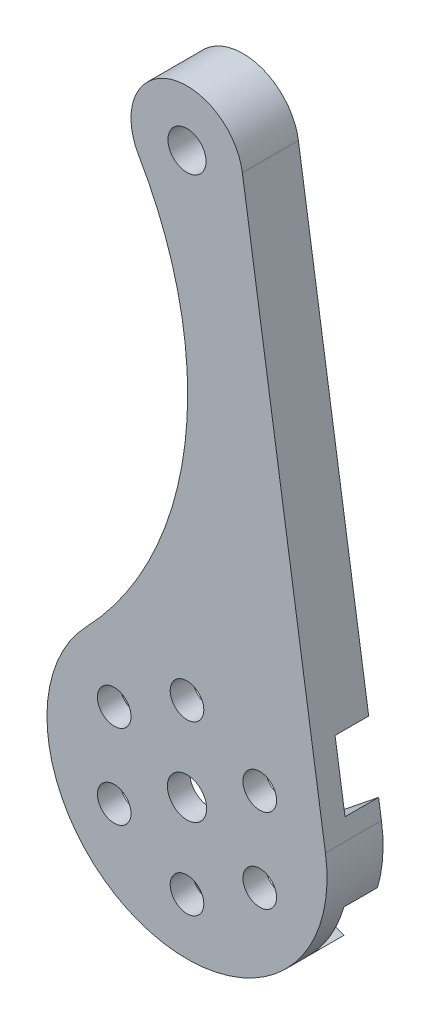
ISO-10303-21;
HEADER;
FILE_DESCRIPTION(('STEP AP214'),'2;1');
FILE_NAME('part.step','',(''),(''),'','','');
FILE_SCHEMA(('AUTOMOTIVE_DESIGN { 1 0 10303 214 1 1 1 1 }'));
ENDSEC;
DATA;
#1=APPLICATION_CONTEXT('core data for automotive mechanical design processes');
#2=APPLICATION_PROTOCOL_DEFINITION('international standard','automotive_design',2000,#1);
#3=PRODUCT_CONTEXT('',#1,'mechanical');
#4=PRODUCT('Part','Part','',(#3));
#5=PRODUCT_RELATED_PRODUCT_CATEGORY('part','',(#4));
#6=PRODUCT_DEFINITION_FORMATION('','',#4);
#7=PRODUCT_DEFINITION_CONTEXT('part definition',#1,'design');
#8=PRODUCT_DEFINITION('design','',#6,#7);
#9=PRODUCT_DEFINITION_SHAPE('','',#8);
#10=(LENGTH_UNIT() NAMED_UNIT(*) SI_UNIT(.MILLI.,.METRE.));
#11=(NAMED_UNIT(*) PLANE_ANGLE_UNIT() SI_UNIT($,.RADIAN.));
#12=(NAMED_UNIT(*) SI_UNIT($,.STERADIAN.) SOLID_ANGLE_UNIT());
#13=UNCERTAINTY_MEASURE_WITH_UNIT(LENGTH_MEASURE(1.E-05),#10,'distance_accuracy_value','');
#14=(GEOMETRIC_REPRESENTATION_CONTEXT(3) GLOBAL_UNCERTAINTY_ASSIGNED_CONTEXT((#13)) GLOBAL_UNIT_ASSIGNED_CONTEXT((#10,
#11,#12)) REPRESENTATION_CONTEXT('',''));
#15=CARTESIAN_POINT('',(0.,0.,0.));
#16=DIRECTION('',(0.,0.,1.));
#17=DIRECTION('',(1.,0.,0.));
#18=AXIS2_PLACEMENT_3D('',#15,#16,#17);
#19=CARTESIAN_POINT('',(0.,50.,0.));
#20=DIRECTION('',(0.,0.,1.));
#21=DIRECTION('',(1.,0.,0.));
#22=AXIS2_PLACEMENT_3D('',#19,#20,#21);
#23=PLANE('',#22);
#24=CARTESIAN_POINT('',(-8.48279779752659E-13,-7.5,0.));
#25=DIRECTION('',(0.,0.,1.));
#26=DIRECTION('',(1.,0.,0.));
#27=AXIS2_PLACEMENT_3D('',#24,#25,#26);
#28=CIRCLE('',#27,1.50000000000067);
#29=CARTESIAN_POINT('',(1.49999999999982,-7.5,0.));
#30=VERTEX_POINT('',#29);
#31=EDGE_CURVE('E335',#30,#30,#28,.T.);
#32=ORIENTED_EDGE('',*,*,#31,.T.);
#33=EDGE_LOOP('',(#32));
#34=FACE_BOUND('',#33,.T.);
#35=CARTESIAN_POINT('',(6.4951905283837,3.7499999999993,0.));
#36=DIRECTION('',(0.,0.,1.));
#37=DIRECTION('',(1.,0.,0.));
#38=AXIS2_PLACEMENT_3D('',#35,#36,#37);
#39=CIRCLE('',#38,1.50000000000066);
#40=CARTESIAN_POINT('',(7.99519052838436,3.7499999999993,0.));
#41=VERTEX_POINT('',#40);
#42=EDGE_CURVE('E345',#41,#41,#39,.T.);
#43=ORIENTED_EDGE('',*,*,#42,.T.);
#44=EDGE_LOOP('',(#43));
#45=FACE_BOUND('',#44,.T.);
#46=CARTESIAN_POINT('',(-6.4951905283829,3.75000000000068,0.));
#47=DIRECTION('',(0.,0.,1.));
#48=DIRECTION('',(1.,0.,0.));
#49=AXIS2_PLACEMENT_3D('',#46,#47,#48);
#50=CIRCLE('',#49,1.50000000000067);
#51=CARTESIAN_POINT('',(-4.99519052838224,3.75000000000068,0.));
#52=VERTEX_POINT('',#51);
#53=EDGE_CURVE('E357',#52,#52,#50,.T.);
#54=ORIENTED_EDGE('',*,*,#53,.T.);
#55=EDGE_LOOP('',(#54));
#56=FACE_BOUND('',#55,.T.);
#57=CARTESIAN_POINT('',(0.,0.,0.));
#58=DIRECTION('',(0.,0.,1.));
#59=DIRECTION('',(1.,0.,0.));
#60=AXIS2_PLACEMENT_3D('',#57,#58,#59);
#61=CIRCLE('',#60,1.75);
#62=CARTESIAN_POINT('',(1.75,0.,0.));
#63=VERTEX_POINT('',#62);
#64=EDGE_CURVE('E369',#63,#63,#61,.T.);
#65=ORIENTED_EDGE('',*,*,#64,.T.);
#66=EDGE_LOOP('',(#65));
#67=FACE_BOUND('',#66,.T.);
#68=CARTESIAN_POINT('',(-6.49519052838367,-3.74999999999934,0.));
#69=DIRECTION('',(0.,0.,1.));
#70=DIRECTION('',(1.,0.,0.));
#71=AXIS2_PLACEMENT_3D('',#68,#69,#70);
#72=CIRCLE('',#71,1.50000000000067);
#73=CARTESIAN_POINT('',(-4.99519052838301,-3.74999999999934,0.));
#74=VERTEX_POINT('',#73);
#75=EDGE_CURVE('E363',#74,#74,#72,.T.);
#76=ORIENTED_EDGE('',*,*,#75,.T.);
#77=EDGE_LOOP('',(#76));
#78=FACE_BOUND('',#77,.T.);
#79=CARTESIAN_POINT('',(7.97105437211343E-13,7.5,0.));
#80=DIRECTION('',(0.,0.,1.));
#81=DIRECTION('',(1.,0.,0.));
#82=AXIS2_PLACEMENT_3D('',#79,#80,#81);
#83=CIRCLE('',#82,1.50000000000067);
#84=CARTESIAN_POINT('',(1.50000000000146,7.5,0.));
#85=VERTEX_POINT('',#84);
#86=EDGE_CURVE('E351',#85,#85,#83,.T.);
#87=ORIENTED_EDGE('',*,*,#86,.T.);
#88=EDGE_LOOP('',(#87));
#89=FACE_BOUND('',#88,.T.);
#90=CARTESIAN_POINT('',(6.49519052838288,-3.75000000000072,0.));
#91=DIRECTION('',(0.,0.,1.));
#92=DIRECTION('',(1.,0.,0.));
#93=AXIS2_PLACEMENT_3D('',#90,#91,#92);
#94=CIRCLE('',#93,1.50000000000067);
#95=CARTESIAN_POINT('',(7.99519052838354,-3.75000000000072,0.));
#96=VERTEX_POINT('',#95);
#97=EDGE_CURVE('E339',#96,#96,#94,.T.);
#98=ORIENTED_EDGE('',*,*,#97,.T.);
#99=EDGE_LOOP('',(#98));
#100=FACE_BOUND('',#99,.T.);
#101=DIRECTION('',(0.779547654562301,-0.626342920664404,0.));
#102=VECTOR('',#101,1.);
#103=CARTESIAN_POINT('',(-7.68755668384382,1.25048875678787E-12,0.));
#104=LINE('',#103,#102);
#105=CARTESIAN_POINT('',(-12.0082601084042,3.47155428719018,0.));
#106=VERTEX_POINT('',#105);
#107=CARTESIAN_POINT('',(-7.68755668384382,1.25048875678787E-12,0.));
#108=VERTEX_POINT('',#107);
#109=EDGE_CURVE('E484',#106,#108,#104,.T.);
#110=ORIENTED_EDGE('',*,*,#109,.F.);
#111=CARTESIAN_POINT('',(0.,0.,0.));
#112=DIRECTION('',(0.,0.,1.));
#113=DIRECTION('',(1.,0.,0.));
#114=AXIS2_PLACEMENT_3D('',#111,#112,#113);
#115=CIRCLE('',#114,12.5);
#116=CARTESIAN_POINT('',(-9.0105842575255,8.66368116553429,0.));
#117=VERTEX_POINT('',#116);
#118=EDGE_CURVE('E209',#117,#106,#115,.T.);
#119=ORIENTED_EDGE('',*,*,#118,.F.);
#120=DIRECTION('',(-0.932202708057186,0.361936611979016,0.));
#121=VECTOR('',#120,1.);
#122=CARTESIAN_POINT('',(-9.01058425752549,8.66368116553429,0.));
#123=LINE('',#122,#121);
#124=CARTESIAN_POINT('',(-3.84377834192083,6.65761938124223,0.));
#125=VERTEX_POINT('',#124);
#126=EDGE_CURVE('E283',#125,#117,#123,.T.);
#127=ORIENTED_EDGE('',*,*,#126,.F.);
#128=DIRECTION('',(-0.152655053494769,-0.98827953264373,0.));
#129=VECTOR('',#128,1.);
#130=CARTESIAN_POINT('',(-3.84377834192083,6.65761938124223,0.));
#131=LINE('',#130,#129);
#132=CARTESIAN_POINT('',(-2.76718269140233,13.6274341497861,0.));
#133=VERTEX_POINT('',#132);
#134=EDGE_CURVE('E312',#133,#125,#131,.T.);
#135=ORIENTED_EDGE('',*,*,#134,.F.);
#136=CARTESIAN_POINT('',(0.,13.2,0.));
#137=DIRECTION('',(0.,0.,1.));
#138=DIRECTION('',(-1.,0.,0.));
#139=AXIS2_PLACEMENT_3D('',#136,#137,#138);
#140=CIRCLE('',#139,2.8);
#141=CARTESIAN_POINT('',(2.76718269140233,13.6274341497861,0.));
#142=VERTEX_POINT('',#141);
#143=EDGE_CURVE('E309',#142,#133,#140,.T.);
#144=ORIENTED_EDGE('',*,*,#143,.F.);
#145=DIRECTION('',(-0.152655053495043,0.988279532643688,0.));
#146=VECTOR('',#145,1.);
#147=CARTESIAN_POINT('',(2.76718269140233,13.6274341497861,0.));
#148=LINE('',#147,#146);
#149=CARTESIAN_POINT('',(3.843778341923,6.65761938124099,0.));
#150=VERTEX_POINT('',#149);
#151=EDGE_CURVE('E306',#150,#142,#148,.T.);
#152=ORIENTED_EDGE('',*,*,#151,.F.);
#153=DIRECTION('',(-0.93220270805706,-0.361936611979342,0.));
#154=VECTOR('',#153,1.);
#155=CARTESIAN_POINT('',(3.843778341923,6.65761938124099,0.));
#156=LINE('',#155,#154);
#157=CARTESIAN_POINT('',(10.418112816413,9.21016758256016,0.));
#158=VERTEX_POINT('',#157);
#159=EDGE_CURVE('E303',#158,#150,#156,.T.);
#160=ORIENTED_EDGE('',*,*,#159,.F.);
#161=CARTESIAN_POINT('',(11.4315353299545,6.60000000000013,0.));
#162=DIRECTION('',(0.,0.,1.));
#163=DIRECTION('',(-1.,0.,0.));
#164=AXIS2_PLACEMENT_3D('',#161,#162,#163);
#165=CIRCLE('',#164,2.8);
#166=CARTESIAN_POINT('',(11.2181436054501,9.39185672481842,0.));
#167=VERTEX_POINT('',#166);
#168=EDGE_CURVE('E278',#167,#158,#165,.T.);
#169=ORIENTED_EDGE('',*,*,#168,.F.);
#170=DIRECTION('',(-0.15,0.988685996664259,0.));
#171=VECTOR('',#170,1.);
#172=CARTESIAN_POINT('',(4.9434299833213,50.75,0.));
#173=LINE('',#172,#171);
#174=CARTESIAN_POINT('',(12.1046066841659,3.54896584157715,0.));
#175=VERTEX_POINT('',#174);
#176=EDGE_CURVE('E40',#175,#167,#173,.T.);
#177=ORIENTED_EDGE('',*,*,#176,.F.);
#178=DIRECTION('',(0.779547654562117,0.626342920664632,0.));
#179=VECTOR('',#178,1.);
#180=CARTESIAN_POINT('',(12.1046066841659,3.54896584157714,0.));
#181=LINE('',#180,#179);
#182=CARTESIAN_POINT('',(7.68755668384406,-9.84448888018168E-13,0.));
#183=VERTEX_POINT('',#182);
#184=EDGE_CURVE('E252',#183,#175,#181,.T.);
#185=ORIENTED_EDGE('',*,*,#184,.F.);
#186=DIRECTION('',(-0.779547654562277,0.626342920664433,0.));
#187=VECTOR('',#186,1.);
#188=CARTESIAN_POINT('',(7.68755668384406,-9.84448888018168E-13,0.));
#189=LINE('',#188,#187);
#190=CARTESIAN_POINT('',(12.0082601084042,-3.47155428719002,0.));
#191=VERTEX_POINT('',#190);
#192=EDGE_CURVE('E257',#191,#183,#189,.T.);
#193=ORIENTED_EDGE('',*,*,#192,.F.);
#194=CARTESIAN_POINT('',(9.01058425752534,-8.66368116553445,0.));
#195=VERTEX_POINT('',#194);
#196=EDGE_CURVE('E380',#195,#191,#115,.T.);
#197=ORIENTED_EDGE('',*,*,#196,.F.);
#198=DIRECTION('',(0.932202708057173,-0.36193661197905,0.));
#199=VECTOR('',#198,1.);
#200=CARTESIAN_POINT('',(9.01058425752534,-8.66368116553445,0.));
#201=LINE('',#200,#199);
#202=CARTESIAN_POINT('',(3.84377834192083,-6.65761938124223,0.));
#203=VERTEX_POINT('',#202);
#204=EDGE_CURVE('E237',#203,#195,#201,.T.);
#205=ORIENTED_EDGE('',*,*,#204,.F.);
#206=DIRECTION('',(0.152655053494756,0.988279532643732,0.));
#207=VECTOR('',#206,1.);
#208=CARTESIAN_POINT('',(3.84377834192083,-6.65761938124223,0.));
#209=LINE('',#208,#207);
#210=CARTESIAN_POINT('',(2.99767585087867,-12.1352354527244,0.));
#211=VERTEX_POINT('',#210);
#212=EDGE_CURVE('E232',#211,#203,#209,.T.);
#213=ORIENTED_EDGE('',*,*,#212,.F.);
#214=CARTESIAN_POINT('',(-2.99767585087896,-12.1352354527243,0.));
#215=VERTEX_POINT('',#214);
#216=EDGE_CURVE('E667',#215,#211,#115,.T.);
#217=ORIENTED_EDGE('',*,*,#216,.F.);
#218=DIRECTION('',(0.152655053495055,-0.988279532643686,0.));
#219=VECTOR('',#218,1.);
#220=CARTESIAN_POINT('',(-2.99767585087896,-12.1352354527243,0.));
#221=LINE('',#220,#219);
#222=CARTESIAN_POINT('',(-3.84377834192294,-6.65761938124131,0.));
#223=VERTEX_POINT('',#222);
#224=EDGE_CURVE('E212',#223,#215,#221,.T.);
#225=ORIENTED_EDGE('',*,*,#224,.F.);
#226=DIRECTION('',(0.932202708057081,0.361936611979287,0.));
#227=VECTOR('',#226,1.);
#228=CARTESIAN_POINT('',(-3.84377834192294,-6.65761938124131,0.));
#229=LINE('',#228,#227);
#230=CARTESIAN_POINT('',(-9.0105842575255,-8.66368116553429,0.));
#231=VERTEX_POINT('',#230);
#232=EDGE_CURVE('E210',#231,#223,#229,.T.);
#233=ORIENTED_EDGE('',*,*,#232,.F.);
#234=CARTESIAN_POINT('',(-12.0082601084043,-3.47155428718982,0.));
#235=VERTEX_POINT('',#234);
#236=EDGE_CURVE('E391',#235,#231,#115,.T.);
#237=ORIENTED_EDGE('',*,*,#236,.F.);
#238=DIRECTION('',(-0.77954765456212,-0.626342920664629,0.));
#239=VECTOR('',#238,1.);
#240=CARTESIAN_POINT('',(-12.0082601084043,-3.47155428718982,0.));
#241=LINE('',#240,#239);
#242=EDGE_CURVE('E204',#108,#235,#241,.T.);
#243=ORIENTED_EDGE('',*,*,#242,.F.);
#244=EDGE_LOOP('',(#110,#119,#127,#135,#144,#152,#160,#169,#177,#185,#193,#197,#205,#213,#217,
#225,#233,#237,#243));
#245=FACE_BOUND('',#244,.T.);
#246=ADVANCED_FACE('F36',(#34,#45,#56,#67,#78,#89,#100,#245),#23,.F.);
#247=CARTESIAN_POINT('',(0.,50.,2.));
#248=DIRECTION('',(0.,0.,1.));
#249=DIRECTION('',(1.,0.,0.));
#250=AXIS2_PLACEMENT_3D('',#247,#248,#249);
#251=PLANE('',#250);
#252=CARTESIAN_POINT('',(6.49519052838288,-3.75000000000072,2.));
#253=DIRECTION('',(0.,0.,1.));
#254=DIRECTION('',(1.,0.,0.));
#255=AXIS2_PLACEMENT_3D('',#252,#253,#254);
#256=CIRCLE('',#255,1.50000000000067);
#257=CARTESIAN_POINT('',(7.99519052838354,-3.75000000000072,2.));
#258=VERTEX_POINT('',#257);
#259=EDGE_CURVE('E342',#258,#258,#256,.T.);
#260=ORIENTED_EDGE('',*,*,#259,.F.);
#261=EDGE_LOOP('',(#260));
#262=FACE_BOUND('',#261,.T.);
#263=CARTESIAN_POINT('',(7.97105437211343E-13,7.5,2.));
#264=DIRECTION('',(0.,0.,1.));
#265=DIRECTION('',(1.,0.,0.));
#266=AXIS2_PLACEMENT_3D('',#263,#264,#265);
#267=CIRCLE('',#266,1.50000000000067);
#268=CARTESIAN_POINT('',(1.50000000000146,7.5,2.));
#269=VERTEX_POINT('',#268);
#270=EDGE_CURVE('E354',#269,#269,#267,.T.);
#271=ORIENTED_EDGE('',*,*,#270,.F.);
#272=EDGE_LOOP('',(#271));
#273=FACE_BOUND('',#272,.T.);
#274=CARTESIAN_POINT('',(-6.49519052838367,-3.74999999999934,2.));
#275=DIRECTION('',(0.,0.,1.));
#276=DIRECTION('',(1.,0.,0.));
#277=AXIS2_PLACEMENT_3D('',#274,#275,#276);
#278=CIRCLE('',#277,1.50000000000067);
#279=CARTESIAN_POINT('',(-4.99519052838301,-3.74999999999934,2.));
#280=VERTEX_POINT('',#279);
#281=EDGE_CURVE('E366',#280,#280,#278,.T.);
#282=ORIENTED_EDGE('',*,*,#281,.F.);
#283=EDGE_LOOP('',(#282));
#284=FACE_BOUND('',#283,.T.);
#285=CARTESIAN_POINT('',(0.,50.,2.));
#286=DIRECTION('',(0.,0.,1.));
#287=DIRECTION('',(1.,0.,0.));
#288=AXIS2_PLACEMENT_3D('',#285,#286,#287);
#289=CIRCLE('',#288,1.7);
#290=CARTESIAN_POINT('',(1.7,50.,2.));
#291=VERTEX_POINT('',#290);
#292=EDGE_CURVE('E375',#291,#291,#289,.T.);
#293=ORIENTED_EDGE('',*,*,#292,.F.);
#294=EDGE_LOOP('',(#293));
#295=FACE_BOUND('',#294,.T.);
#296=CARTESIAN_POINT('',(0.,50.,2.));
#297=DIRECTION('',(0.,0.,1.));
#298=DIRECTION('',(1.,0.,0.));
#299=AXIS2_PLACEMENT_3D('',#296,#297,#298);
#300=CIRCLE('',#299,5.);
#301=CARTESIAN_POINT('',(4.9434299833213,50.75,2.));
#302=VERTEX_POINT('',#301);
#303=CARTESIAN_POINT('',(-4.3251424671171,47.4913863112986,2.));
#304=VERTEX_POINT('',#303);
#305=EDGE_CURVE('E381',#302,#304,#300,.T.);
#306=ORIENTED_EDGE('',*,*,#305,.T.);
#307=CARTESIAN_POINT('',(-32.4357776457674,31.1870160521939,2.));
#308=DIRECTION('',(0.,0.,-1.));
#309=DIRECTION('',(-1.,0.,0.));
#310=AXIS2_PLACEMENT_3D('',#307,#308,#309);
#311=CIRCLE('',#310,32.4967736812926);
#312=CARTESIAN_POINT('',(-9.0105842575255,8.66368116553429,2.));
#313=VERTEX_POINT('',#312);
#314=EDGE_CURVE('E384',#304,#313,#311,.T.);
#315=ORIENTED_EDGE('',*,*,#314,.T.);
#316=CARTESIAN_POINT('',(0.,0.,2.));
#317=DIRECTION('',(0.,0.,1.));
#318=DIRECTION('',(1.,0.,0.));
#319=AXIS2_PLACEMENT_3D('',#316,#317,#318);
#320=CIRCLE('',#319,12.5);
#321=CARTESIAN_POINT('',(12.3585749583032,1.875,2.));
#322=VERTEX_POINT('',#321);
#323=EDGE_CURVE('E386',#313,#322,#320,.T.);
#324=ORIENTED_EDGE('',*,*,#323,.T.);
#325=DIRECTION('',(-0.15,0.988685996664259,0.));
#326=VECTOR('',#325,1.);
#327=CARTESIAN_POINT('',(4.9434299833213,50.75,2.));
#328=LINE('',#327,#326);
#329=EDGE_CURVE('E388',#322,#302,#328,.T.);
#330=ORIENTED_EDGE('',*,*,#329,.T.);
#331=EDGE_LOOP('',(#306,#315,#324,#330));
#332=FACE_BOUND('',#331,.T.);
#333=CARTESIAN_POINT('',(0.,0.,2.));
#334=DIRECTION('',(0.,0.,1.));
#335=DIRECTION('',(1.,0.,0.));
#336=AXIS2_PLACEMENT_3D('',#333,#334,#335);
#337=CIRCLE('',#336,1.75);
#338=CARTESIAN_POINT('',(1.75,0.,2.));
#339=VERTEX_POINT('',#338);
#340=EDGE_CURVE('E372',#339,#339,#337,.T.);
#341=ORIENTED_EDGE('',*,*,#340,.F.);
#342=EDGE_LOOP('',(#341));
#343=FACE_BOUND('',#342,.T.);
#344=CARTESIAN_POINT('',(-6.4951905283829,3.75000000000068,2.));
#345=DIRECTION('',(0.,0.,1.));
#346=DIRECTION('',(1.,0.,0.));
#347=AXIS2_PLACEMENT_3D('',#344,#345,#346);
#348=CIRCLE('',#347,1.50000000000067);
#349=CARTESIAN_POINT('',(-4.99519052838224,3.75000000000068,2.));
#350=VERTEX_POINT('',#349);
#351=EDGE_CURVE('E360',#350,#350,#348,.T.);
#352=ORIENTED_EDGE('',*,*,#351,.F.);
#353=EDGE_LOOP('',(#352));
#354=FACE_BOUND('',#353,.T.);
#355=CARTESIAN_POINT('',(6.4951905283837,3.7499999999993,2.));
#356=DIRECTION('',(0.,0.,1.));
#357=DIRECTION('',(1.,0.,0.));
#358=AXIS2_PLACEMENT_3D('',#355,#356,#357);
#359=CIRCLE('',#358,1.50000000000066);
#360=CARTESIAN_POINT('',(7.99519052838436,3.7499999999993,2.));
#361=VERTEX_POINT('',#360);
#362=EDGE_CURVE('E348',#361,#361,#359,.T.);
#363=ORIENTED_EDGE('',*,*,#362,.F.);
#364=EDGE_LOOP('',(#363));
#365=FACE_BOUND('',#364,.T.);
#366=CARTESIAN_POINT('',(-8.48279779752659E-13,-7.5,2.));
#367=DIRECTION('',(0.,0.,1.));
#368=DIRECTION('',(1.,0.,0.));
#369=AXIS2_PLACEMENT_3D('',#366,#367,#368);
#370=CIRCLE('',#369,1.50000000000067);
#371=CARTESIAN_POINT('',(1.49999999999982,-7.5,2.));
#372=VERTEX_POINT('',#371);
#373=EDGE_CURVE('E336',#372,#372,#370,.T.);
#374=ORIENTED_EDGE('',*,*,#373,.F.);
#375=EDGE_LOOP('',(#374));
#376=FACE_BOUND('',#375,.T.);
#377=ADVANCED_FACE('F433',(#262,#273,#284,#295,#332,#343,#354,#365,#376),#251,.T.);
#378=CARTESIAN_POINT('',(0.,50.,2.));
#379=DIRECTION('',(0.,0.,-1.));
#380=DIRECTION('',(-1.,0.,0.));
#381=AXIS2_PLACEMENT_3D('',#378,#379,#380);
#382=CYLINDRICAL_SURFACE('',#381,5.);
#383=DIRECTION('',(0.,0.,-1.));
#384=VECTOR('',#383,1.);
#385=CARTESIAN_POINT('',(4.9434299833213,50.75,2.));
#386=LINE('',#385,#384);
#387=CARTESIAN_POINT('',(4.9434299833213,50.75,-3.));
#388=VERTEX_POINT('',#387);
#389=EDGE_CURVE('E390',#302,#388,#386,.T.);
#390=ORIENTED_EDGE('',*,*,#389,.T.);
#391=CARTESIAN_POINT('',(0.,50.,-3.));
#392=DIRECTION('',(0.,0.,-1.));
#393=DIRECTION('',(-1.,0.,0.));
#394=AXIS2_PLACEMENT_3D('',#391,#392,#393);
#395=CIRCLE('',#394,5.);
#396=CARTESIAN_POINT('',(-4.3251424671171,47.4913863112986,-3.));
#397=VERTEX_POINT('',#396);
#398=EDGE_CURVE('E296',#397,#388,#395,.T.);
#399=ORIENTED_EDGE('',*,*,#398,.F.);
#400=DIRECTION('',(0.,0.,-1.));
#401=VECTOR('',#400,1.);
#402=CARTESIAN_POINT('',(-4.3251424671171,47.4913863112986,2.));
#403=LINE('',#402,#401);
#404=EDGE_CURVE('E11',#304,#397,#403,.T.);
#405=ORIENTED_EDGE('',*,*,#404,.F.);
#406=ORIENTED_EDGE('',*,*,#305,.F.);
#407=EDGE_LOOP('',(#390,#399,#405,#406));
#408=FACE_BOUND('',#407,.T.);
#409=ADVANCED_FACE('F38',(#408),#382,.T.);
#410=CARTESIAN_POINT('',(-32.4357776457674,31.1870160521939,2.));
#411=DIRECTION('',(0.,0.,-1.));
#412=DIRECTION('',(-1.,0.,0.));
#413=AXIS2_PLACEMENT_3D('',#410,#411,#412);
#414=CYLINDRICAL_SURFACE('',#413,32.4967736812926);
#415=ORIENTED_EDGE('',*,*,#404,.T.);
#416=CARTESIAN_POINT('',(-32.4357776457674,31.1870160521939,-3.));
#417=DIRECTION('',(0.,0.,1.));
#418=DIRECTION('',(-1.,0.,0.));
#419=AXIS2_PLACEMENT_3D('',#416,#417,#418);
#420=CIRCLE('',#419,32.4967736812926);
#421=CARTESIAN_POINT('',(-9.01058425752548,8.6636811655343,-3.));
#422=VERTEX_POINT('',#421);
#423=EDGE_CURVE('E293',#422,#397,#420,.T.);
#424=ORIENTED_EDGE('',*,*,#423,.F.);
#425=DIRECTION('',(0.,0.,1.));
#426=VECTOR('',#425,1.);
#427=CARTESIAN_POINT('',(-9.01058425752548,8.6636811655343,-3.));
#428=LINE('',#427,#426);
#429=EDGE_CURVE('E317',#422,#117,#428,.T.);
#430=ORIENTED_EDGE('',*,*,#429,.T.);
#431=DIRECTION('',(0.,0.,-1.));
#432=VECTOR('',#431,1.);
#433=CARTESIAN_POINT('',(-9.0105842575255,8.66368116553429,2.));
#434=LINE('',#433,#432);
#435=EDGE_CURVE('E46',#313,#117,#434,.T.);
#436=ORIENTED_EDGE('',*,*,#435,.F.);
#437=ORIENTED_EDGE('',*,*,#314,.F.);
#438=EDGE_LOOP('',(#415,#424,#430,#436,#437));
#439=FACE_BOUND('',#438,.T.);
#440=ADVANCED_FACE('F476',(#439),#414,.F.);
#441=CARTESIAN_POINT('',(0.,0.,2.));
#442=DIRECTION('',(0.,0.,-1.));
#443=DIRECTION('',(-1.,0.,0.));
#444=AXIS2_PLACEMENT_3D('',#441,#442,#443);
#445=CYLINDRICAL_SURFACE('',#444,12.5);
#446=ORIENTED_EDGE('',*,*,#118,.T.);
#447=DIRECTION('',(0.,0.,1.));
#448=VECTOR('',#447,1.);
#449=CARTESIAN_POINT('',(-12.0082601084042,3.47155428719018,-3.));
#450=LINE('',#449,#448);
#451=CARTESIAN_POINT('',(-12.0082601084042,3.47155428719018,-3.));
#452=VERTEX_POINT('',#451);
#453=EDGE_CURVE('E194',#452,#106,#450,.T.);
#454=ORIENTED_EDGE('',*,*,#453,.F.);
#455=CARTESIAN_POINT('',(0.,0.,-3.));
#456=DIRECTION('',(0.,0.,-1.));
#457=DIRECTION('',(-1.,0.,0.));
#458=AXIS2_PLACEMENT_3D('',#455,#456,#457);
#459=CIRCLE('',#458,12.5);
#460=CARTESIAN_POINT('',(-12.0082601084043,-3.47155428718982,-3.));
#461=VERTEX_POINT('',#460);
#462=EDGE_CURVE('E201',#461,#452,#459,.T.);
#463=ORIENTED_EDGE('',*,*,#462,.F.);
#464=DIRECTION('',(0.,0.,1.));
#465=VECTOR('',#464,1.);
#466=CARTESIAN_POINT('',(-12.0082601084043,-3.47155428718982,-3.));
#467=LINE('',#466,#465);
#468=EDGE_CURVE('E54',#461,#235,#467,.T.);
#469=ORIENTED_EDGE('',*,*,#468,.T.);
#470=ORIENTED_EDGE('',*,*,#236,.T.);
#471=DIRECTION('',(0.,0.,1.));
#472=VECTOR('',#471,1.);
#473=CARTESIAN_POINT('',(-9.0105842575255,-8.66368116553429,-3.));
#474=LINE('',#473,#472);
#475=CARTESIAN_POINT('',(-9.0105842575255,-8.66368116553429,-3.));
#476=VERTEX_POINT('',#475);
#477=EDGE_CURVE('E229',#476,#231,#474,.T.);
#478=ORIENTED_EDGE('',*,*,#477,.F.);
#479=CARTESIAN_POINT('',(0.,0.,-3.));
#480=DIRECTION('',(0.,0.,-1.));
#481=DIRECTION('',(-1.,0.,0.));
#482=AXIS2_PLACEMENT_3D('',#479,#480,#481);
#483=CIRCLE('',#482,12.5);
#484=CARTESIAN_POINT('',(-2.99767585087896,-12.1352354527243,-3.));
#485=VERTEX_POINT('',#484);
#486=EDGE_CURVE('E217',#485,#476,#483,.T.);
#487=ORIENTED_EDGE('',*,*,#486,.F.);
#488=DIRECTION('',(0.,0.,1.));
#489=VECTOR('',#488,1.);
#490=CARTESIAN_POINT('',(-2.99767585087896,-12.1352354527243,-3.));
#491=LINE('',#490,#489);
#492=EDGE_CURVE('E61',#485,#215,#491,.T.);
#493=ORIENTED_EDGE('',*,*,#492,.T.);
#494=ORIENTED_EDGE('',*,*,#216,.T.);
#495=DIRECTION('',(0.,0.,1.));
#496=VECTOR('',#495,1.);
#497=CARTESIAN_POINT('',(2.99767585087867,-12.1352354527244,-3.));
#498=LINE('',#497,#496);
#499=CARTESIAN_POINT('',(2.99767585087867,-12.1352354527244,-3.));
#500=VERTEX_POINT('',#499);
#501=EDGE_CURVE('E249',#500,#211,#498,.T.);
#502=ORIENTED_EDGE('',*,*,#501,.F.);
#503=CARTESIAN_POINT('',(0.,0.,-3.));
#504=DIRECTION('',(0.,0.,-1.));
#505=DIRECTION('',(-1.,0.,0.));
#506=AXIS2_PLACEMENT_3D('',#503,#504,#505);
#507=CIRCLE('',#506,12.5);
#508=CARTESIAN_POINT('',(9.01058425752534,-8.66368116553445,-3.));
#509=VERTEX_POINT('',#508);
#510=EDGE_CURVE('E233',#509,#500,#507,.T.);
#511=ORIENTED_EDGE('',*,*,#510,.F.);
#512=DIRECTION('',(0.,0.,1.));
#513=VECTOR('',#512,1.);
#514=CARTESIAN_POINT('',(9.01058425752534,-8.66368116553445,-3.));
#515=LINE('',#514,#513);
#516=EDGE_CURVE('E241',#509,#195,#515,.T.);
#517=ORIENTED_EDGE('',*,*,#516,.T.);
#518=ORIENTED_EDGE('',*,*,#196,.T.);
#519=DIRECTION('',(0.,0.,1.));
#520=VECTOR('',#519,1.);
#521=CARTESIAN_POINT('',(12.0082601084042,-3.47155428719002,-3.));
#522=LINE('',#521,#520);
#523=CARTESIAN_POINT('',(12.0082601084042,-3.47155428719002,-3.));
#524=VERTEX_POINT('',#523);
#525=EDGE_CURVE('E269',#524,#191,#522,.T.);
#526=ORIENTED_EDGE('',*,*,#525,.F.);
#527=CARTESIAN_POINT('',(0.,0.,-3.));
#528=DIRECTION('',(0.,0.,-1.));
#529=DIRECTION('',(-1.,0.,0.));
#530=AXIS2_PLACEMENT_3D('',#527,#528,#529);
#531=CIRCLE('',#530,12.5);
#532=CARTESIAN_POINT('',(12.3585749583032,1.875,-3.));
#533=VERTEX_POINT('',#532);
#534=EDGE_CURVE('E260',#533,#524,#531,.T.);
#535=ORIENTED_EDGE('',*,*,#534,.F.);
#536=DIRECTION('',(0.,0.,-1.));
#537=VECTOR('',#536,1.);
#538=CARTESIAN_POINT('',(12.3585749583032,1.875,2.));
#539=LINE('',#538,#537);
#540=EDGE_CURVE('E395',#322,#533,#539,.T.);
#541=ORIENTED_EDGE('',*,*,#540,.F.);
#542=ORIENTED_EDGE('',*,*,#323,.F.);
#543=ORIENTED_EDGE('',*,*,#435,.T.);
#544=EDGE_LOOP('',(#446,#454,#463,#469,#470,#478,#487,#493,#494,#502,#511,#517,#518,#526,#535,
#541,#542,#543));
#545=FACE_BOUND('',#544,.T.);
#546=ADVANCED_FACE('F207',(#545),#445,.T.);
#547=CARTESIAN_POINT('',(4.9434299833213,50.75,2.));
#548=DIRECTION('',(-0.988685996664259,-0.15,0.));
#549=DIRECTION('',(0.15,-0.98868599666426,0.));
#550=AXIS2_PLACEMENT_3D('',#547,#548,#549);
#551=PLANE('',#550);
#552=ORIENTED_EDGE('',*,*,#540,.T.);
#553=DIRECTION('',(0.150000000000002,-0.988685996664259,0.));
#554=VECTOR('',#553,1.);
#555=CARTESIAN_POINT('',(12.1046066841659,3.54896584157714,-3.));
#556=LINE('',#555,#554);
#557=CARTESIAN_POINT('',(12.1046066841659,3.54896584157714,-3.));
#558=VERTEX_POINT('',#557);
#559=EDGE_CURVE('E256',#558,#533,#556,.T.);
#560=ORIENTED_EDGE('',*,*,#559,.F.);
#561=DIRECTION('',(0.,0.,1.));
#562=VECTOR('',#561,1.);
#563=CARTESIAN_POINT('',(12.1046066841659,3.54896584157714,-3.));
#564=LINE('',#563,#562);
#565=EDGE_CURVE('E272',#558,#175,#564,.T.);
#566=ORIENTED_EDGE('',*,*,#565,.T.);
#567=ORIENTED_EDGE('',*,*,#176,.T.);
#568=DIRECTION('',(0.,0.,1.));
#569=VECTOR('',#568,1.);
#570=CARTESIAN_POINT('',(11.2181436054501,9.39185672481841,-3.));
#571=LINE('',#570,#569);
#572=CARTESIAN_POINT('',(11.2181436054501,9.39185672481841,-3.));
#573=VERTEX_POINT('',#572);
#574=EDGE_CURVE('E302',#573,#167,#571,.T.);
#575=ORIENTED_EDGE('',*,*,#574,.F.);
#576=DIRECTION('',(0.15,-0.98868599666426,0.));
#577=VECTOR('',#576,1.);
#578=CARTESIAN_POINT('',(4.9434299833213,50.75,-3.));
#579=LINE('',#578,#577);
#580=EDGE_CURVE('E299',#388,#573,#579,.T.);
#581=ORIENTED_EDGE('',*,*,#580,.F.);
#582=ORIENTED_EDGE('',*,*,#389,.F.);
#583=ORIENTED_EDGE('',*,*,#329,.F.);
#584=EDGE_LOOP('',(#552,#560,#566,#567,#575,#581,#582,#583));
#585=FACE_BOUND('',#584,.T.);
#586=ADVANCED_FACE('F412',(#585),#551,.F.);
#587=CARTESIAN_POINT('',(0.,50.,2.));
#588=DIRECTION('',(0.,0.,-1.));
#589=DIRECTION('',(-1.,0.,0.));
#590=AXIS2_PLACEMENT_3D('',#587,#588,#589);
#591=CYLINDRICAL_SURFACE('',#590,1.7);
#592=ORIENTED_EDGE('',*,*,#292,.T.);
#593=EDGE_LOOP('',(#592));
#594=FACE_BOUND('',#593,.T.);
#595=CARTESIAN_POINT('',(0.,50.,-3.));
#596=DIRECTION('',(0.,0.,-1.));
#597=DIRECTION('',(-1.,0.,0.));
#598=AXIS2_PLACEMENT_3D('',#595,#596,#597);
#599=CIRCLE('',#598,1.7);
#600=CARTESIAN_POINT('',(-1.7,50.,-3.));
#601=VERTEX_POINT('',#600);
#602=EDGE_CURVE('E275',#601,#601,#599,.T.);
#603=ORIENTED_EDGE('',*,*,#602,.T.);
#604=EDGE_LOOP('',(#603));
#605=FACE_BOUND('',#604,.T.);
#606=ADVANCED_FACE('F474',(#594,#605),#591,.F.);
#607=CARTESIAN_POINT('',(0.,0.,2.));
#608=DIRECTION('',(0.,0.,-1.));
#609=DIRECTION('',(-1.,0.,0.));
#610=AXIS2_PLACEMENT_3D('',#607,#608,#609);
#611=CYLINDRICAL_SURFACE('',#610,1.75);
#612=ORIENTED_EDGE('',*,*,#340,.T.);
#613=EDGE_LOOP('',(#612));
#614=FACE_BOUND('',#613,.T.);
#615=ORIENTED_EDGE('',*,*,#64,.F.);
#616=EDGE_LOOP('',(#615));
#617=FACE_BOUND('',#616,.T.);
#618=ADVANCED_FACE('F533',(#614,#617),#611,.F.);
#619=CARTESIAN_POINT('',(-6.49519052838367,-3.74999999999934,2.));
#620=DIRECTION('',(0.,0.,-1.));
#621=DIRECTION('',(-1.,0.,0.));
#622=AXIS2_PLACEMENT_3D('',#619,#620,#621);
#623=CYLINDRICAL_SURFACE('',#622,1.50000000000067);
#624=ORIENTED_EDGE('',*,*,#281,.T.);
#625=EDGE_LOOP('',(#624));
#626=FACE_BOUND('',#625,.T.);
#627=ORIENTED_EDGE('',*,*,#75,.F.);
#628=EDGE_LOOP('',(#627));
#629=FACE_BOUND('',#628,.T.);
#630=ADVANCED_FACE('F529',(#626,#629),#623,.F.);
#631=CARTESIAN_POINT('',(-6.4951905283829,3.75000000000068,2.));
#632=DIRECTION('',(0.,0.,-1.));
#633=DIRECTION('',(-1.,0.,0.));
#634=AXIS2_PLACEMENT_3D('',#631,#632,#633);
#635=CYLINDRICAL_SURFACE('',#634,1.50000000000067);
#636=ORIENTED_EDGE('',*,*,#351,.T.);
#637=EDGE_LOOP('',(#636));
#638=FACE_BOUND('',#637,.T.);
#639=ORIENTED_EDGE('',*,*,#53,.F.);
#640=EDGE_LOOP('',(#639));
#641=FACE_BOUND('',#640,.T.);
#642=ADVANCED_FACE('F525',(#638,#641),#635,.F.);
#643=CARTESIAN_POINT('',(7.97105437211343E-13,7.5,2.));
#644=DIRECTION('',(0.,0.,-1.));
#645=DIRECTION('',(-1.,0.,0.));
#646=AXIS2_PLACEMENT_3D('',#643,#644,#645);
#647=CYLINDRICAL_SURFACE('',#646,1.50000000000067);
#648=ORIENTED_EDGE('',*,*,#270,.T.);
#649=EDGE_LOOP('',(#648));
#650=FACE_BOUND('',#649,.T.);
#651=ORIENTED_EDGE('',*,*,#86,.F.);
#652=EDGE_LOOP('',(#651));
#653=FACE_BOUND('',#652,.T.);
#654=ADVANCED_FACE('F521',(#650,#653),#647,.F.);
#655=CARTESIAN_POINT('',(6.4951905283837,3.7499999999993,2.));
#656=DIRECTION('',(0.,0.,-1.));
#657=DIRECTION('',(-1.,0.,0.));
#658=AXIS2_PLACEMENT_3D('',#655,#656,#657);
#659=CYLINDRICAL_SURFACE('',#658,1.50000000000066);
#660=ORIENTED_EDGE('',*,*,#362,.T.);
#661=EDGE_LOOP('',(#660));
#662=FACE_BOUND('',#661,.T.);
#663=ORIENTED_EDGE('',*,*,#42,.F.);
#664=EDGE_LOOP('',(#663));
#665=FACE_BOUND('',#664,.T.);
#666=ADVANCED_FACE('F517',(#662,#665),#659,.F.);
#667=CARTESIAN_POINT('',(6.49519052838288,-3.75000000000072,2.));
#668=DIRECTION('',(0.,0.,-1.));
#669=DIRECTION('',(-1.,0.,0.));
#670=AXIS2_PLACEMENT_3D('',#667,#668,#669);
#671=CYLINDRICAL_SURFACE('',#670,1.50000000000067);
#672=ORIENTED_EDGE('',*,*,#259,.T.);
#673=EDGE_LOOP('',(#672));
#674=FACE_BOUND('',#673,.T.);
#675=ORIENTED_EDGE('',*,*,#97,.F.);
#676=EDGE_LOOP('',(#675));
#677=FACE_BOUND('',#676,.T.);
#678=ADVANCED_FACE('F513',(#674,#677),#671,.F.);
#679=CARTESIAN_POINT('',(-8.48279779752659E-13,-7.5,2.));
#680=DIRECTION('',(0.,0.,-1.));
#681=DIRECTION('',(-1.,0.,0.));
#682=AXIS2_PLACEMENT_3D('',#679,#680,#681);
#683=CYLINDRICAL_SURFACE('',#682,1.50000000000067);
#684=ORIENTED_EDGE('',*,*,#373,.T.);
#685=EDGE_LOOP('',(#684));
#686=FACE_BOUND('',#685,.T.);
#687=ORIENTED_EDGE('',*,*,#31,.F.);
#688=EDGE_LOOP('',(#687));
#689=FACE_BOUND('',#688,.T.);
#690=ADVANCED_FACE('F510',(#686,#689),#683,.F.);
#691=CARTESIAN_POINT('',(11.4315353299545,6.60000000000013,-3.));
#692=DIRECTION('',(0.,0.,-1.));
#693=DIRECTION('',(-1.,0.,0.));
#694=AXIS2_PLACEMENT_3D('',#691,#692,#693);
#695=PLANE('',#694);
#696=CARTESIAN_POINT('',(11.4315353299545,6.60000000000013,-3.));
#697=DIRECTION('',(0.,0.,1.));
#698=DIRECTION('',(-1.,0.,0.));
#699=AXIS2_PLACEMENT_3D('',#696,#697,#698);
#700=CIRCLE('',#699,2.8);
#701=CARTESIAN_POINT('',(10.418112816413,9.21016758256016,-3.));
#702=VERTEX_POINT('',#701);
#703=EDGE_CURVE('E279',#573,#702,#700,.T.);
#704=ORIENTED_EDGE('',*,*,#703,.T.);
#705=DIRECTION('',(-0.93220270805706,-0.361936611979342,0.));
#706=VECTOR('',#705,1.);
#707=CARTESIAN_POINT('',(3.843778341923,6.65761938124099,-3.));
#708=LINE('',#707,#706);
#709=CARTESIAN_POINT('',(3.843778341923,6.65761938124099,-3.));
#710=VERTEX_POINT('',#709);
#711=EDGE_CURVE('E282',#702,#710,#708,.T.);
#712=ORIENTED_EDGE('',*,*,#711,.T.);
#713=DIRECTION('',(-0.152655053495043,0.988279532643688,0.));
#714=VECTOR('',#713,1.);
#715=CARTESIAN_POINT('',(2.76718269140233,13.6274341497861,-3.));
#716=LINE('',#715,#714);
#717=CARTESIAN_POINT('',(2.76718269140233,13.6274341497861,-3.));
#718=VERTEX_POINT('',#717);
#719=EDGE_CURVE('E285',#710,#718,#716,.T.);
#720=ORIENTED_EDGE('',*,*,#719,.T.);
#721=CARTESIAN_POINT('',(0.,13.2,-3.));
#722=DIRECTION('',(0.,0.,1.));
#723=DIRECTION('',(-1.,0.,0.));
#724=AXIS2_PLACEMENT_3D('',#721,#722,#723);
#725=CIRCLE('',#724,2.8);
#726=CARTESIAN_POINT('',(-2.76718269140233,13.6274341497861,-3.));
#727=VERTEX_POINT('',#726);
#728=EDGE_CURVE('E287',#718,#727,#725,.T.);
#729=ORIENTED_EDGE('',*,*,#728,.T.);
#730=DIRECTION('',(-0.152655053494769,-0.98827953264373,0.));
#731=VECTOR('',#730,1.);
#732=CARTESIAN_POINT('',(-3.84377834192083,6.65761938124223,-3.));
#733=LINE('',#732,#731);
#734=CARTESIAN_POINT('',(-3.84377834192083,6.65761938124223,-3.));
#735=VERTEX_POINT('',#734);
#736=EDGE_CURVE('E289',#727,#735,#733,.T.);
#737=ORIENTED_EDGE('',*,*,#736,.T.);
#738=DIRECTION('',(-0.932202708057186,0.361936611979016,0.));
#739=VECTOR('',#738,1.);
#740=CARTESIAN_POINT('',(-9.01058425752549,8.66368116553429,-3.));
#741=LINE('',#740,#739);
#742=EDGE_CURVE('E291',#735,#422,#741,.T.);
#743=ORIENTED_EDGE('',*,*,#742,.T.);
#744=ORIENTED_EDGE('',*,*,#423,.T.);
#745=ORIENTED_EDGE('',*,*,#398,.T.);
#746=ORIENTED_EDGE('',*,*,#580,.T.);
#747=EDGE_LOOP('',(#704,#712,#720,#729,#737,#743,#744,#745,#746));
#748=FACE_BOUND('',#747,.T.);
#749=ORIENTED_EDGE('',*,*,#602,.F.);
#750=EDGE_LOOP('',(#749));
#751=FACE_BOUND('',#750,.T.);
#752=ADVANCED_FACE('F423',(#748,#751),#695,.T.);
#753=CARTESIAN_POINT('',(11.4315353299545,6.60000000000013,-3.));
#754=DIRECTION('',(0.,0.,1.));
#755=DIRECTION('',(1.,0.,0.));
#756=AXIS2_PLACEMENT_3D('',#753,#754,#755);
#757=CYLINDRICAL_SURFACE('',#756,2.8);
#758=ORIENTED_EDGE('',*,*,#168,.T.);
#759=DIRECTION('',(0.,0.,1.));
#760=VECTOR('',#759,1.);
#761=CARTESIAN_POINT('',(10.418112816413,9.21016758256016,-3.));
#762=LINE('',#761,#760);
#763=EDGE_CURVE('E332',#702,#158,#762,.T.);
#764=ORIENTED_EDGE('',*,*,#763,.F.);
#765=ORIENTED_EDGE('',*,*,#703,.F.);
#766=ORIENTED_EDGE('',*,*,#574,.T.);
#767=EDGE_LOOP('',(#758,#764,#765,#766));
#768=FACE_BOUND('',#767,.T.);
#769=ADVANCED_FACE('F407',(#768),#757,.F.);
#770=CARTESIAN_POINT('',(3.843778341923,6.65761938124099,-3.));
#771=DIRECTION('',(-0.361936611979342,0.93220270805706,0.));
#772=DIRECTION('',(-0.93220270805706,-0.361936611979342,0.));
#773=AXIS2_PLACEMENT_3D('',#770,#771,#772);
#774=PLANE('',#773);
#775=ORIENTED_EDGE('',*,*,#159,.T.);
#776=DIRECTION('',(0.,0.,1.));
#777=VECTOR('',#776,1.);
#778=CARTESIAN_POINT('',(3.843778341923,6.65761938124099,-3.));
#779=LINE('',#778,#777);
#780=EDGE_CURVE('E329',#710,#150,#779,.T.);
#781=ORIENTED_EDGE('',*,*,#780,.F.);
#782=ORIENTED_EDGE('',*,*,#711,.F.);
#783=ORIENTED_EDGE('',*,*,#763,.T.);
#784=EDGE_LOOP('',(#775,#781,#782,#783));
#785=FACE_BOUND('',#784,.T.);
#786=ADVANCED_FACE('F420',(#785),#774,.F.);
#787=CARTESIAN_POINT('',(2.76718269140233,13.6274341497861,-3.));
#788=DIRECTION('',(0.988279532643688,0.152655053495043,0.));
#789=DIRECTION('',(-0.152655053495043,0.988279532643688,0.));
#790=AXIS2_PLACEMENT_3D('',#787,#788,#789);
#791=PLANE('',#790);
#792=ORIENTED_EDGE('',*,*,#151,.T.);
#793=DIRECTION('',(0.,0.,1.));
#794=VECTOR('',#793,1.);
#795=CARTESIAN_POINT('',(2.76718269140233,13.6274341497861,-3.));
#796=LINE('',#795,#794);
#797=EDGE_CURVE('E326',#718,#142,#796,.T.);
#798=ORIENTED_EDGE('',*,*,#797,.F.);
#799=ORIENTED_EDGE('',*,*,#719,.F.);
#800=ORIENTED_EDGE('',*,*,#780,.T.);
#801=EDGE_LOOP('',(#792,#798,#799,#800));
#802=FACE_BOUND('',#801,.T.);
#803=ADVANCED_FACE('F497',(#802),#791,.F.);
#804=CARTESIAN_POINT('',(0.,13.2,-3.));
#805=DIRECTION('',(0.,0.,1.));
#806=DIRECTION('',(1.,0.,0.));
#807=AXIS2_PLACEMENT_3D('',#804,#805,#806);
#808=CYLINDRICAL_SURFACE('',#807,2.8);
#809=ORIENTED_EDGE('',*,*,#143,.T.);
#810=DIRECTION('',(0.,0.,1.));
#811=VECTOR('',#810,1.);
#812=CARTESIAN_POINT('',(-2.76718269140233,13.6274341497861,-3.));
#813=LINE('',#812,#811);
#814=EDGE_CURVE('E323',#727,#133,#813,.T.);
#815=ORIENTED_EDGE('',*,*,#814,.F.);
#816=ORIENTED_EDGE('',*,*,#728,.F.);
#817=ORIENTED_EDGE('',*,*,#797,.T.);
#818=EDGE_LOOP('',(#809,#815,#816,#817));
#819=FACE_BOUND('',#818,.T.);
#820=ADVANCED_FACE('F493',(#819),#808,.F.);
#821=CARTESIAN_POINT('',(-3.84377834192083,6.65761938124223,-3.));
#822=DIRECTION('',(-0.98827953264373,0.152655053494769,0.));
#823=DIRECTION('',(-0.152655053494769,-0.98827953264373,0.));
#824=AXIS2_PLACEMENT_3D('',#821,#822,#823);
#825=PLANE('',#824);
#826=ORIENTED_EDGE('',*,*,#134,.T.);
#827=DIRECTION('',(0.,0.,1.));
#828=VECTOR('',#827,1.);
#829=CARTESIAN_POINT('',(-3.84377834192083,6.65761938124223,-3.));
#830=LINE('',#829,#828);
#831=EDGE_CURVE('E320',#735,#125,#830,.T.);
#832=ORIENTED_EDGE('',*,*,#831,.F.);
#833=ORIENTED_EDGE('',*,*,#736,.F.);
#834=ORIENTED_EDGE('',*,*,#814,.T.);
#835=EDGE_LOOP('',(#826,#832,#833,#834));
#836=FACE_BOUND('',#835,.T.);
#837=ADVANCED_FACE('F490',(#836),#825,.F.);
#838=CARTESIAN_POINT('',(-9.01058425752549,8.66368116553429,-3.));
#839=DIRECTION('',(0.361936611979016,0.932202708057186,0.));
#840=DIRECTION('',(-0.932202708057186,0.361936611979016,0.));
#841=AXIS2_PLACEMENT_3D('',#838,#839,#840);
#842=PLANE('',#841);
#843=ORIENTED_EDGE('',*,*,#126,.T.);
#844=ORIENTED_EDGE('',*,*,#429,.F.);
#845=ORIENTED_EDGE('',*,*,#742,.F.);
#846=ORIENTED_EDGE('',*,*,#831,.T.);
#847=EDGE_LOOP('',(#843,#844,#845,#846));
#848=FACE_BOUND('',#847,.T.);
#849=ADVANCED_FACE('F459',(#848),#842,.F.);
#850=CARTESIAN_POINT('',(12.1046066841659,3.54896584157714,-3.));
#851=DIRECTION('',(0.626342920664632,-0.779547654562117,0.));
#852=DIRECTION('',(0.779547654562117,0.626342920664632,0.));
#853=AXIS2_PLACEMENT_3D('',#850,#851,#852);
#854=PLANE('',#853);
#855=ORIENTED_EDGE('',*,*,#184,.T.);
#856=ORIENTED_EDGE('',*,*,#565,.F.);
#857=DIRECTION('',(0.779547654562117,0.626342920664632,0.));
#858=VECTOR('',#857,1.);
#859=CARTESIAN_POINT('',(12.1046066841659,3.54896584157714,-3.));
#860=LINE('',#859,#858);
#861=CARTESIAN_POINT('',(7.68755668384406,-9.84448888018168E-13,-3.));
#862=VERTEX_POINT('',#861);
#863=EDGE_CURVE('E253',#862,#558,#860,.T.);
#864=ORIENTED_EDGE('',*,*,#863,.F.);
#865=DIRECTION('',(0.,0.,1.));
#866=VECTOR('',#865,1.);
#867=CARTESIAN_POINT('',(7.68755668384406,-9.84448888018168E-13,-3.));
#868=LINE('',#867,#866);
#869=EDGE_CURVE('E264',#862,#183,#868,.T.);
#870=ORIENTED_EDGE('',*,*,#869,.T.);
#871=EDGE_LOOP('',(#855,#856,#864,#870));
#872=FACE_BOUND('',#871,.T.);
#873=ADVANCED_FACE('F445',(#872),#854,.F.);
#874=CARTESIAN_POINT('',(7.68755668384406,-9.84448888018168E-13,-3.));
#875=DIRECTION('',(0.626342920664433,0.779547654562277,0.));
#876=DIRECTION('',(-0.779547654562277,0.626342920664433,0.));
#877=AXIS2_PLACEMENT_3D('',#874,#875,#876);
#878=PLANE('',#877);
#879=ORIENTED_EDGE('',*,*,#192,.T.);
#880=ORIENTED_EDGE('',*,*,#869,.F.);
#881=DIRECTION('',(-0.779547654562277,0.626342920664433,0.));
#882=VECTOR('',#881,1.);
#883=CARTESIAN_POINT('',(7.68755668384406,-9.84448888018168E-13,-3.));
#884=LINE('',#883,#882);
#885=EDGE_CURVE('E262',#524,#862,#884,.T.);
#886=ORIENTED_EDGE('',*,*,#885,.F.);
#887=ORIENTED_EDGE('',*,*,#525,.T.);
#888=EDGE_LOOP('',(#879,#880,#886,#887));
#889=FACE_BOUND('',#888,.T.);
#890=ADVANCED_FACE('F450',(#889),#878,.F.);
#891=CARTESIAN_POINT('',(0.,0.,-3.));
#892=DIRECTION('',(0.,0.,-1.));
#893=DIRECTION('',(-1.,0.,0.));
#894=AXIS2_PLACEMENT_3D('',#891,#892,#893);
#895=PLANE('',#894);
#896=ORIENTED_EDGE('',*,*,#863,.T.);
#897=ORIENTED_EDGE('',*,*,#559,.T.);
#898=ORIENTED_EDGE('',*,*,#534,.T.);
#899=ORIENTED_EDGE('',*,*,#885,.T.);
#900=EDGE_LOOP('',(#896,#897,#898,#899));
#901=FACE_BOUND('',#900,.T.);
#902=ADVANCED_FACE('F441',(#901),#895,.T.);
#903=CARTESIAN_POINT('',(3.84377834192083,-6.65761938124223,-3.));
#904=DIRECTION('',(0.988279532643732,-0.152655053494756,0.));
#905=DIRECTION('',(0.152655053494756,0.988279532643732,0.));
#906=AXIS2_PLACEMENT_3D('',#903,#904,#905);
#907=PLANE('',#906);
#908=ORIENTED_EDGE('',*,*,#212,.T.);
#909=DIRECTION('',(0.,0.,1.));
#910=VECTOR('',#909,1.);
#911=CARTESIAN_POINT('',(3.84377834192083,-6.65761938124223,-3.));
#912=LINE('',#911,#910);
#913=CARTESIAN_POINT('',(3.84377834192083,-6.65761938124223,-3.));
#914=VERTEX_POINT('',#913);
#915=EDGE_CURVE('E246',#914,#203,#912,.T.);
#916=ORIENTED_EDGE('',*,*,#915,.F.);
#917=DIRECTION('',(0.152655053494756,0.988279532643732,0.));
#918=VECTOR('',#917,1.);
#919=CARTESIAN_POINT('',(3.84377834192083,-6.65761938124223,-3.));
#920=LINE('',#919,#918);
#921=EDGE_CURVE('E236',#500,#914,#920,.T.);
#922=ORIENTED_EDGE('',*,*,#921,.F.);
#923=ORIENTED_EDGE('',*,*,#501,.T.);
#924=EDGE_LOOP('',(#908,#916,#922,#923));
#925=FACE_BOUND('',#924,.T.);
#926=ADVANCED_FACE('F457',(#925),#907,.F.);
#927=CARTESIAN_POINT('',(9.01058425752534,-8.66368116553445,-3.));
#928=DIRECTION('',(-0.36193661197905,-0.932202708057173,0.));
#929=DIRECTION('',(0.932202708057173,-0.36193661197905,0.));
#930=AXIS2_PLACEMENT_3D('',#927,#928,#929);
#931=PLANE('',#930);
#932=ORIENTED_EDGE('',*,*,#204,.T.);
#933=ORIENTED_EDGE('',*,*,#516,.F.);
#934=DIRECTION('',(0.932202708057173,-0.36193661197905,0.));
#935=VECTOR('',#934,1.);
#936=CARTESIAN_POINT('',(9.01058425752534,-8.66368116553445,-3.));
#937=LINE('',#936,#935);
#938=EDGE_CURVE('E239',#914,#509,#937,.T.);
#939=ORIENTED_EDGE('',*,*,#938,.F.);
#940=ORIENTED_EDGE('',*,*,#915,.T.);
#941=EDGE_LOOP('',(#932,#933,#939,#940));
#942=FACE_BOUND('',#941,.T.);
#943=ADVANCED_FACE('F582',(#942),#931,.F.);
#944=CARTESIAN_POINT('',(0.,0.,-3.));
#945=DIRECTION('',(0.,0.,-1.));
#946=DIRECTION('',(-1.,0.,0.));
#947=AXIS2_PLACEMENT_3D('',#944,#945,#946);
#948=PLANE('',#947);
#949=ORIENTED_EDGE('',*,*,#510,.T.);
#950=ORIENTED_EDGE('',*,*,#921,.T.);
#951=ORIENTED_EDGE('',*,*,#938,.T.);
#952=EDGE_LOOP('',(#949,#950,#951));
#953=FACE_BOUND('',#952,.T.);
#954=ADVANCED_FACE('F592',(#953),#948,.T.);
#955=CARTESIAN_POINT('',(-3.84377834192294,-6.65761938124131,-3.));
#956=DIRECTION('',(0.361936611979287,-0.932202708057081,0.));
#957=DIRECTION('',(0.932202708057081,0.361936611979287,0.));
#958=AXIS2_PLACEMENT_3D('',#955,#956,#957);
#959=PLANE('',#958);
#960=ORIENTED_EDGE('',*,*,#232,.T.);
#961=DIRECTION('',(0.,0.,1.));
#962=VECTOR('',#961,1.);
#963=CARTESIAN_POINT('',(-3.84377834192294,-6.65761938124131,-3.));
#964=LINE('',#963,#962);
#965=CARTESIAN_POINT('',(-3.84377834192294,-6.65761938124131,-3.));
#966=VERTEX_POINT('',#965);
#967=EDGE_CURVE('E226',#966,#223,#964,.T.);
#968=ORIENTED_EDGE('',*,*,#967,.F.);
#969=DIRECTION('',(0.932202708057081,0.361936611979287,0.));
#970=VECTOR('',#969,1.);
#971=CARTESIAN_POINT('',(-3.84377834192294,-6.65761938124131,-3.));
#972=LINE('',#971,#970);
#973=EDGE_CURVE('E220',#476,#966,#972,.T.);
#974=ORIENTED_EDGE('',*,*,#973,.F.);
#975=ORIENTED_EDGE('',*,*,#477,.T.);
#976=EDGE_LOOP('',(#960,#968,#974,#975));
#977=FACE_BOUND('',#976,.T.);
#978=ADVANCED_FACE('F602',(#977),#959,.F.);
#979=CARTESIAN_POINT('',(-2.99767585087896,-12.1352354527243,-3.));
#980=DIRECTION('',(-0.988279532643686,-0.152655053495055,0.));
#981=DIRECTION('',(0.152655053495055,-0.988279532643686,0.));
#982=AXIS2_PLACEMENT_3D('',#979,#980,#981);
#983=PLANE('',#982);
#984=ORIENTED_EDGE('',*,*,#224,.T.);
#985=ORIENTED_EDGE('',*,*,#492,.F.);
#986=DIRECTION('',(0.152655053495055,-0.988279532643686,0.));
#987=VECTOR('',#986,1.);
#988=CARTESIAN_POINT('',(-2.99767585087896,-12.1352354527243,-3.));
#989=LINE('',#988,#987);
#990=EDGE_CURVE('E222',#966,#485,#989,.T.);
#991=ORIENTED_EDGE('',*,*,#990,.F.);
#992=ORIENTED_EDGE('',*,*,#967,.T.);
#993=EDGE_LOOP('',(#984,#985,#991,#992));
#994=FACE_BOUND('',#993,.T.);
#995=ADVANCED_FACE('F612',(#994),#983,.F.);
#996=CARTESIAN_POINT('',(0.,0.,-3.));
#997=DIRECTION('',(0.,0.,-1.));
#998=DIRECTION('',(-1.,0.,0.));
#999=AXIS2_PLACEMENT_3D('',#996,#997,#998);
#1000=PLANE('',#999);
#1001=ORIENTED_EDGE('',*,*,#486,.T.);
#1002=ORIENTED_EDGE('',*,*,#973,.T.);
#1003=ORIENTED_EDGE('',*,*,#990,.T.);
#1004=EDGE_LOOP('',(#1001,#1002,#1003));
#1005=FACE_BOUND('',#1004,.T.);
#1006=ADVANCED_FACE('F622',(#1005),#1000,.T.);
#1007=CARTESIAN_POINT('',(-7.68755668384382,1.25048875678787E-12,-3.));
#1008=DIRECTION('',(-0.626342920664404,-0.779547654562301,0.));
#1009=DIRECTION('',(0.779547654562301,-0.626342920664404,0.));
#1010=AXIS2_PLACEMENT_3D('',#1007,#1008,#1009);
#1011=PLANE('',#1010);
#1012=ORIENTED_EDGE('',*,*,#109,.T.);
#1013=DIRECTION('',(0.,0.,1.));
#1014=VECTOR('',#1013,1.);
#1015=CARTESIAN_POINT('',(-7.68755668384382,1.25048875678787E-12,-3.));
#1016=LINE('',#1015,#1014);
#1017=CARTESIAN_POINT('',(-7.68755668384382,1.25048875678787E-12,-3.));
#1018=VERTEX_POINT('',#1017);
#1019=EDGE_CURVE('E197',#1018,#108,#1016,.T.);
#1020=ORIENTED_EDGE('',*,*,#1019,.F.);
#1021=DIRECTION('',(0.779547654562301,-0.626342920664404,0.));
#1022=VECTOR('',#1021,1.);
#1023=CARTESIAN_POINT('',(-7.68755668384382,1.25048875678787E-12,-3.));
#1024=LINE('',#1023,#1022);
#1025=EDGE_CURVE('E190',#452,#1018,#1024,.T.);
#1026=ORIENTED_EDGE('',*,*,#1025,.F.);
#1027=ORIENTED_EDGE('',*,*,#453,.T.);
#1028=EDGE_LOOP('',(#1012,#1020,#1026,#1027));
#1029=FACE_BOUND('',#1028,.T.);
#1030=ADVANCED_FACE('F192',(#1029),#1011,.F.);
#1031=CARTESIAN_POINT('',(-12.0082601084043,-3.47155428718982,-3.));
#1032=DIRECTION('',(-0.626342920664629,0.779547654562119,0.));
#1033=DIRECTION('',(-0.779547654562119,-0.626342920664629,0.));
#1034=AXIS2_PLACEMENT_3D('',#1031,#1032,#1033);
#1035=PLANE('',#1034);
#1036=ORIENTED_EDGE('',*,*,#242,.T.);
#1037=ORIENTED_EDGE('',*,*,#468,.F.);
#1038=DIRECTION('',(-0.77954765456212,-0.626342920664629,0.));
#1039=VECTOR('',#1038,1.);
#1040=CARTESIAN_POINT('',(-12.0082601084043,-3.47155428718982,-3.));
#1041=LINE('',#1040,#1039);
#1042=EDGE_CURVE('E200',#1018,#461,#1041,.T.);
#1043=ORIENTED_EDGE('',*,*,#1042,.F.);
#1044=ORIENTED_EDGE('',*,*,#1019,.T.);
#1045=EDGE_LOOP('',(#1036,#1037,#1043,#1044));
#1046=FACE_BOUND('',#1045,.T.);
#1047=ADVANCED_FACE('F641',(#1046),#1035,.F.);
#1048=CARTESIAN_POINT('',(0.,0.,-3.));
#1049=DIRECTION('',(0.,0.,-1.));
#1050=DIRECTION('',(-1.,0.,0.));
#1051=AXIS2_PLACEMENT_3D('',#1048,#1049,#1050);
#1052=PLANE('',#1051);
#1053=ORIENTED_EDGE('',*,*,#462,.T.);
#1054=ORIENTED_EDGE('',*,*,#1025,.T.);
#1055=ORIENTED_EDGE('',*,*,#1042,.T.);
#1056=EDGE_LOOP('',(#1053,#1054,#1055));
#1057=FACE_BOUND('',#1056,.T.);
#1058=ADVANCED_FACE('F203',(#1057),#1052,.T.);
#1059=CLOSED_SHELL('',(#246,#377,#409,#440,#546,#586,#606,#618,#630,#642,#654,#666,#678,#690,
#752,#769,#786,#803,#820,#837,#849,#873,#890,#902,#926,#943,#954,#978,#995,#1006,#1030,#1047,#1058));
#1060=MANIFOLD_SOLID_BREP('B2',#1059);
#1061=ADVANCED_BREP_SHAPE_REPRESENTATION('',(#18,#1060),#14);
#1062=SHAPE_DEFINITION_REPRESENTATION(#9,#1061);
ENDSEC;
END-ISO-10303-21;
